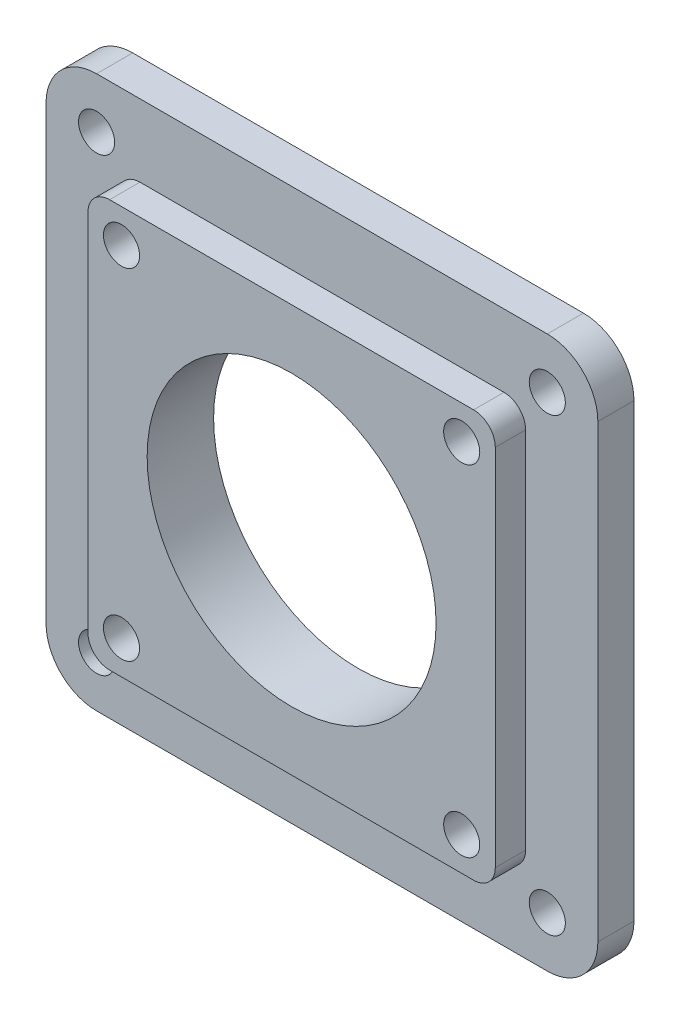
ISO-10303-21;
HEADER;
FILE_DESCRIPTION(('STEP AP214'),'2;1');
FILE_NAME('part.step','',(''),(''),'','','');
FILE_SCHEMA(('AUTOMOTIVE_DESIGN { 1 0 10303 214 1 1 1 1 }'));
ENDSEC;
DATA;
#1=APPLICATION_CONTEXT('core data for automotive mechanical design processes');
#2=APPLICATION_PROTOCOL_DEFINITION('international standard','automotive_design',2000,#1);
#3=PRODUCT_CONTEXT('',#1,'mechanical');
#4=PRODUCT('Part','Part','',(#3));
#5=PRODUCT_RELATED_PRODUCT_CATEGORY('part','',(#4));
#6=PRODUCT_DEFINITION_FORMATION('','',#4);
#7=PRODUCT_DEFINITION_CONTEXT('part definition',#1,'design');
#8=PRODUCT_DEFINITION('design','',#6,#7);
#9=PRODUCT_DEFINITION_SHAPE('','',#8);
#10=(LENGTH_UNIT() NAMED_UNIT(*) SI_UNIT(.MILLI.,.METRE.));
#11=(NAMED_UNIT(*) PLANE_ANGLE_UNIT() SI_UNIT($,.RADIAN.));
#12=(NAMED_UNIT(*) SI_UNIT($,.STERADIAN.) SOLID_ANGLE_UNIT());
#13=UNCERTAINTY_MEASURE_WITH_UNIT(LENGTH_MEASURE(1.E-05),#10,'distance_accuracy_value','');
#14=(GEOMETRIC_REPRESENTATION_CONTEXT(3) GLOBAL_UNCERTAINTY_ASSIGNED_CONTEXT((#13)) GLOBAL_UNIT_ASSIGNED_CONTEXT((#10,
#11,#12)) REPRESENTATION_CONTEXT('',''));
#15=CARTESIAN_POINT('',(0.,0.,0.));
#16=DIRECTION('',(0.,0.,1.));
#17=DIRECTION('',(1.,0.,0.));
#18=AXIS2_PLACEMENT_3D('',#15,#16,#17);
#19=CARTESIAN_POINT('',(28.2,-28.2,4.2));
#20=DIRECTION('',(-1.,0.,0.));
#21=DIRECTION('',(0.,0.,1.));
#22=AXIS2_PLACEMENT_3D('',#19,#20,#21);
#23=PLANE('',#22);
#24=DIRECTION('',(0.,1.,0.));
#25=VECTOR('',#24,1.);
#26=CARTESIAN_POINT('',(28.2,-28.2,4.2));
#27=LINE('',#26,#25);
#28=CARTESIAN_POINT('',(28.2,-25.2,4.2));
#29=VERTEX_POINT('',#28);
#30=CARTESIAN_POINT('',(28.2,25.2,4.2));
#31=VERTEX_POINT('',#30);
#32=EDGE_CURVE('E181',#29,#31,#27,.T.);
#33=ORIENTED_EDGE('',*,*,#32,.F.);
#34=DIRECTION('',(0.,0.,-1.));
#35=VECTOR('',#34,1.);
#36=CARTESIAN_POINT('',(28.2,-25.2,4.2));
#37=LINE('',#36,#35);
#38=CARTESIAN_POINT('',(28.2,-25.2,0.));
#39=VERTEX_POINT('',#38);
#40=EDGE_CURVE('E233',#29,#39,#37,.T.);
#41=ORIENTED_EDGE('',*,*,#40,.T.);
#42=DIRECTION('',(0.,1.,0.));
#43=VECTOR('',#42,1.);
#44=CARTESIAN_POINT('',(28.2,-28.2,0.));
#45=LINE('',#44,#43);
#46=CARTESIAN_POINT('',(28.2,25.2,0.));
#47=VERTEX_POINT('',#46);
#48=EDGE_CURVE('E194',#39,#47,#45,.T.);
#49=ORIENTED_EDGE('',*,*,#48,.T.);
#50=DIRECTION('',(0.,0.,-1.));
#51=VECTOR('',#50,1.);
#52=CARTESIAN_POINT('',(28.2,25.2,4.2));
#53=LINE('',#52,#51);
#54=EDGE_CURVE('E231',#47,#31,#53,.F.);
#55=ORIENTED_EDGE('',*,*,#54,.T.);
#56=EDGE_LOOP('',(#33,#41,#49,#55));
#57=FACE_BOUND('',#56,.T.);
#58=ADVANCED_FACE('F33',(#57),#23,.F.);
#59=CARTESIAN_POINT('',(-28.2,28.2,4.2));
#60=DIRECTION('',(0.,-1.,0.));
#61=DIRECTION('',(0.,0.,-1.));
#62=AXIS2_PLACEMENT_3D('',#59,#60,#61);
#63=PLANE('',#62);
#64=DIRECTION('',(-1.,0.,0.));
#65=VECTOR('',#64,1.);
#66=CARTESIAN_POINT('',(-28.2,28.2,4.2));
#67=LINE('',#66,#65);
#68=CARTESIAN_POINT('',(25.2,28.2,4.2));
#69=VERTEX_POINT('',#68);
#70=CARTESIAN_POINT('',(-25.2,28.2,4.2));
#71=VERTEX_POINT('',#70);
#72=EDGE_CURVE('E184',#69,#71,#67,.T.);
#73=ORIENTED_EDGE('',*,*,#72,.F.);
#74=DIRECTION('',(0.,0.,-1.));
#75=VECTOR('',#74,1.);
#76=CARTESIAN_POINT('',(25.2,28.2,4.2));
#77=LINE('',#76,#75);
#78=CARTESIAN_POINT('',(25.2,28.2,0.));
#79=VERTEX_POINT('',#78);
#80=EDGE_CURVE('E251',#69,#79,#77,.T.);
#81=ORIENTED_EDGE('',*,*,#80,.T.);
#82=DIRECTION('',(-1.,0.,0.));
#83=VECTOR('',#82,1.);
#84=CARTESIAN_POINT('',(-28.2,28.2,0.));
#85=LINE('',#84,#83);
#86=CARTESIAN_POINT('',(-25.2,28.2,0.));
#87=VERTEX_POINT('',#86);
#88=EDGE_CURVE('E197',#79,#87,#85,.T.);
#89=ORIENTED_EDGE('',*,*,#88,.T.);
#90=DIRECTION('',(0.,0.,-1.));
#91=VECTOR('',#90,1.);
#92=CARTESIAN_POINT('',(-25.2,28.2,4.2));
#93=LINE('',#92,#91);
#94=EDGE_CURVE('E249',#87,#71,#93,.F.);
#95=ORIENTED_EDGE('',*,*,#94,.T.);
#96=EDGE_LOOP('',(#73,#81,#89,#95));
#97=FACE_BOUND('',#96,.T.);
#98=ADVANCED_FACE('F276',(#97),#63,.F.);
#99=CARTESIAN_POINT('',(-28.2,-28.2,4.2));
#100=DIRECTION('',(1.,0.,0.));
#101=DIRECTION('',(0.,0.,-1.));
#102=AXIS2_PLACEMENT_3D('',#99,#100,#101);
#103=PLANE('',#102);
#104=DIRECTION('',(0.,-1.,0.));
#105=VECTOR('',#104,1.);
#106=CARTESIAN_POINT('',(-28.2,-28.2,0.));
#107=LINE('',#106,#105);
#108=CARTESIAN_POINT('',(-28.2,25.2,0.));
#109=VERTEX_POINT('',#108);
#110=CARTESIAN_POINT('',(-28.2,-25.2,0.));
#111=VERTEX_POINT('',#110);
#112=EDGE_CURVE('E201',#109,#111,#107,.T.);
#113=ORIENTED_EDGE('',*,*,#112,.T.);
#114=DIRECTION('',(0.,0.,-1.));
#115=VECTOR('',#114,1.);
#116=CARTESIAN_POINT('',(-28.2,-25.2,4.2));
#117=LINE('',#116,#115);
#118=CARTESIAN_POINT('',(-28.2,-25.2,4.2));
#119=VERTEX_POINT('',#118);
#120=EDGE_CURVE('E256',#111,#119,#117,.F.);
#121=ORIENTED_EDGE('',*,*,#120,.T.);
#122=DIRECTION('',(0.,-1.,0.));
#123=VECTOR('',#122,1.);
#124=CARTESIAN_POINT('',(-28.2,-28.2,4.2));
#125=LINE('',#124,#123);
#126=CARTESIAN_POINT('',(-28.2,25.2,4.2));
#127=VERTEX_POINT('',#126);
#128=EDGE_CURVE('E188',#127,#119,#125,.T.);
#129=ORIENTED_EDGE('',*,*,#128,.F.);
#130=DIRECTION('',(0.,0.,-1.));
#131=VECTOR('',#130,1.);
#132=CARTESIAN_POINT('',(-28.2,25.2,4.2));
#133=LINE('',#132,#131);
#134=EDGE_CURVE('E254',#127,#109,#133,.T.);
#135=ORIENTED_EDGE('',*,*,#134,.T.);
#136=EDGE_LOOP('',(#113,#121,#129,#135));
#137=FACE_BOUND('',#136,.T.);
#138=ADVANCED_FACE('F280',(#137),#103,.F.);
#139=CARTESIAN_POINT('',(-28.2,-28.2,4.2));
#140=DIRECTION('',(0.,1.,0.));
#141=DIRECTION('',(0.,0.,1.));
#142=AXIS2_PLACEMENT_3D('',#139,#140,#141);
#143=PLANE('',#142);
#144=DIRECTION('',(1.,0.,0.));
#145=VECTOR('',#144,1.);
#146=CARTESIAN_POINT('',(-28.2,-28.2,0.));
#147=LINE('',#146,#145);
#148=CARTESIAN_POINT('',(-25.2,-28.2,0.));
#149=VERTEX_POINT('',#148);
#150=CARTESIAN_POINT('',(25.2,-28.2,0.));
#151=VERTEX_POINT('',#150);
#152=EDGE_CURVE('E185',#149,#151,#147,.T.);
#153=ORIENTED_EDGE('',*,*,#152,.T.);
#154=DIRECTION('',(0.,0.,-1.));
#155=VECTOR('',#154,1.);
#156=CARTESIAN_POINT('',(25.2,-28.2,4.2));
#157=LINE('',#156,#155);
#158=CARTESIAN_POINT('',(25.2,-28.2,4.2));
#159=VERTEX_POINT('',#158);
#160=EDGE_CURVE('E239',#151,#159,#157,.F.);
#161=ORIENTED_EDGE('',*,*,#160,.T.);
#162=DIRECTION('',(1.,0.,0.));
#163=VECTOR('',#162,1.);
#164=CARTESIAN_POINT('',(-28.2,-28.2,4.2));
#165=LINE('',#164,#163);
#166=CARTESIAN_POINT('',(-25.2,-28.2,4.2));
#167=VERTEX_POINT('',#166);
#168=EDGE_CURVE('E191',#167,#159,#165,.T.);
#169=ORIENTED_EDGE('',*,*,#168,.F.);
#170=DIRECTION('',(0.,0.,-1.));
#171=VECTOR('',#170,1.);
#172=CARTESIAN_POINT('',(-25.2,-28.2,4.2));
#173=LINE('',#172,#171);
#174=EDGE_CURVE('E236',#167,#149,#173,.T.);
#175=ORIENTED_EDGE('',*,*,#174,.T.);
#176=EDGE_LOOP('',(#153,#161,#169,#175));
#177=FACE_BOUND('',#176,.T.);
#178=ADVANCED_FACE('F288',(#177),#143,.F.);
#179=CARTESIAN_POINT('',(0.,0.,4.2));
#180=DIRECTION('',(0.,0.,-1.));
#181=DIRECTION('',(-1.,0.,0.));
#182=AXIS2_PLACEMENT_3D('',#179,#180,#181);
#183=PLANE('',#182);
#184=CARTESIAN_POINT('',(0.,0.,4.2));
#185=DIRECTION('',(0.,0.,-1.));
#186=DIRECTION('',(-1.,0.,0.));
#187=AXIS2_PLACEMENT_3D('',#184,#185,#186);
#188=CIRCLE('',#187,20.);
#189=CARTESIAN_POINT('',(-20.,0.,4.2));
#190=VERTEX_POINT('',#189);
#191=EDGE_CURVE('E394',#190,#190,#188,.T.);
#192=ORIENTED_EDGE('',*,*,#191,.T.);
#193=EDGE_LOOP('',(#192));
#194=FACE_BOUND('',#193,.T.);
#195=CARTESIAN_POINT('',(23.55,-23.55,4.2));
#196=DIRECTION('',(0.,0.,1.));
#197=DIRECTION('',(1.,0.,0.));
#198=AXIS2_PLACEMENT_3D('',#195,#196,#197);
#199=CIRCLE('',#198,2.5);
#200=CARTESIAN_POINT('',(26.05,-23.55,4.2));
#201=VERTEX_POINT('',#200);
#202=EDGE_CURVE('E346',#201,#201,#199,.T.);
#203=ORIENTED_EDGE('',*,*,#202,.F.);
#204=EDGE_LOOP('',(#203));
#205=FACE_BOUND('',#204,.T.);
#206=CARTESIAN_POINT('',(-23.55,-23.55,4.2));
#207=DIRECTION('',(0.,0.,1.));
#208=DIRECTION('',(1.,0.,0.));
#209=AXIS2_PLACEMENT_3D('',#206,#207,#208);
#210=CIRCLE('',#209,2.5);
#211=CARTESIAN_POINT('',(-21.05,-23.55,4.2));
#212=VERTEX_POINT('',#211);
#213=EDGE_CURVE('E353',#212,#212,#210,.T.);
#214=ORIENTED_EDGE('',*,*,#213,.F.);
#215=EDGE_LOOP('',(#214));
#216=FACE_BOUND('',#215,.T.);
#217=CARTESIAN_POINT('',(-23.55,23.55,4.2));
#218=DIRECTION('',(0.,0.,1.));
#219=DIRECTION('',(1.,0.,0.));
#220=AXIS2_PLACEMENT_3D('',#217,#218,#219);
#221=CIRCLE('',#220,2.5);
#222=CARTESIAN_POINT('',(-21.05,23.55,4.2));
#223=VERTEX_POINT('',#222);
#224=EDGE_CURVE('E360',#223,#223,#221,.T.);
#225=ORIENTED_EDGE('',*,*,#224,.F.);
#226=EDGE_LOOP('',(#225));
#227=FACE_BOUND('',#226,.T.);
#228=CARTESIAN_POINT('',(23.55,23.55,4.2));
#229=DIRECTION('',(0.,0.,1.));
#230=DIRECTION('',(1.,0.,0.));
#231=AXIS2_PLACEMENT_3D('',#228,#229,#230);
#232=CIRCLE('',#231,2.5);
#233=CARTESIAN_POINT('',(26.05,23.55,4.2));
#234=VERTEX_POINT('',#233);
#235=EDGE_CURVE('E342',#234,#234,#232,.T.);
#236=ORIENTED_EDGE('',*,*,#235,.F.);
#237=EDGE_LOOP('',(#236));
#238=FACE_BOUND('',#237,.T.);
#239=ORIENTED_EDGE('',*,*,#168,.T.);
#240=CARTESIAN_POINT('',(25.2,-25.2,4.2));
#241=DIRECTION('',(0.,0.,-1.));
#242=DIRECTION('',(-1.,0.,0.));
#243=AXIS2_PLACEMENT_3D('',#240,#241,#242);
#244=CIRCLE('',#243,3.);
#245=EDGE_CURVE('E247',#159,#29,#244,.F.);
#246=ORIENTED_EDGE('',*,*,#245,.T.);
#247=ORIENTED_EDGE('',*,*,#32,.T.);
#248=CARTESIAN_POINT('',(25.2,25.2,4.2));
#249=DIRECTION('',(0.,0.,-1.));
#250=DIRECTION('',(-1.,0.,0.));
#251=AXIS2_PLACEMENT_3D('',#248,#249,#250);
#252=CIRCLE('',#251,3.);
#253=EDGE_CURVE('E245',#31,#69,#252,.F.);
#254=ORIENTED_EDGE('',*,*,#253,.T.);
#255=ORIENTED_EDGE('',*,*,#72,.T.);
#256=CARTESIAN_POINT('',(-25.2,25.2,4.2));
#257=DIRECTION('',(0.,0.,-1.));
#258=DIRECTION('',(-1.,0.,0.));
#259=AXIS2_PLACEMENT_3D('',#256,#257,#258);
#260=CIRCLE('',#259,3.);
#261=EDGE_CURVE('E241',#71,#127,#260,.F.);
#262=ORIENTED_EDGE('',*,*,#261,.T.);
#263=ORIENTED_EDGE('',*,*,#128,.T.);
#264=CARTESIAN_POINT('',(-25.2,-25.2,4.2));
#265=DIRECTION('',(0.,0.,-1.));
#266=DIRECTION('',(-1.,0.,0.));
#267=AXIS2_PLACEMENT_3D('',#264,#265,#266);
#268=CIRCLE('',#267,3.);
#269=EDGE_CURVE('E243',#119,#167,#268,.F.);
#270=ORIENTED_EDGE('',*,*,#269,.T.);
#271=EDGE_LOOP('',(#239,#246,#247,#254,#255,#262,#263,#270));
#272=FACE_BOUND('',#271,.T.);
#273=ADVANCED_FACE('F273',(#194,#205,#216,#227,#238,#272),#183,.F.);
#274=CARTESIAN_POINT('',(0.,0.,0.));
#275=DIRECTION('',(0.,0.,-1.));
#276=DIRECTION('',(-1.,0.,0.));
#277=AXIS2_PLACEMENT_3D('',#274,#275,#276);
#278=PLANE('',#277);
#279=CARTESIAN_POINT('',(31.1999999999999,31.2000000000001,0.));
#280=DIRECTION('',(0.,0.,-1.));
#281=DIRECTION('',(-1.,0.,0.));
#282=AXIS2_PLACEMENT_3D('',#279,#280,#281);
#283=CIRCLE('',#282,2.5);
#284=CARTESIAN_POINT('',(28.6999999999999,31.2000000000001,0.));
#285=VERTEX_POINT('',#284);
#286=EDGE_CURVE('E378',#285,#285,#283,.T.);
#287=ORIENTED_EDGE('',*,*,#286,.T.);
#288=EDGE_LOOP('',(#287));
#289=FACE_BOUND('',#288,.T.);
#290=CARTESIAN_POINT('',(-31.2000000000002,31.1999999999998,0.));
#291=DIRECTION('',(0.,0.,-1.));
#292=DIRECTION('',(-1.,0.,0.));
#293=AXIS2_PLACEMENT_3D('',#290,#291,#292);
#294=CIRCLE('',#293,2.5);
#295=CARTESIAN_POINT('',(-33.7000000000002,31.1999999999998,0.));
#296=VERTEX_POINT('',#295);
#297=EDGE_CURVE('E383',#296,#296,#294,.T.);
#298=ORIENTED_EDGE('',*,*,#297,.T.);
#299=EDGE_LOOP('',(#298));
#300=FACE_BOUND('',#299,.T.);
#301=CARTESIAN_POINT('',(-31.1999999999997,-31.2000000000003,0.));
#302=DIRECTION('',(0.,0.,-1.));
#303=DIRECTION('',(-1.,0.,0.));
#304=AXIS2_PLACEMENT_3D('',#301,#302,#303);
#305=CIRCLE('',#304,2.5);
#306=CARTESIAN_POINT('',(-33.6999999999997,-31.2000000000003,0.));
#307=VERTEX_POINT('',#306);
#308=EDGE_CURVE('E386',#307,#307,#305,.T.);
#309=ORIENTED_EDGE('',*,*,#308,.T.);
#310=EDGE_LOOP('',(#309));
#311=FACE_BOUND('',#310,.T.);
#312=CARTESIAN_POINT('',(31.2,-31.2,0.));
#313=DIRECTION('',(0.,0.,-1.));
#314=DIRECTION('',(-1.,0.,0.));
#315=AXIS2_PLACEMENT_3D('',#312,#313,#314);
#316=CIRCLE('',#315,2.5);
#317=CARTESIAN_POINT('',(28.7,-31.2,0.));
#318=VERTEX_POINT('',#317);
#319=EDGE_CURVE('E369',#318,#318,#316,.T.);
#320=ORIENTED_EDGE('',*,*,#319,.T.);
#321=EDGE_LOOP('',(#320));
#322=FACE_BOUND('',#321,.T.);
#323=DIRECTION('',(0.,1.,0.));
#324=VECTOR('',#323,1.);
#325=CARTESIAN_POINT('',(-38.2,-38.2,0.));
#326=LINE('',#325,#324);
#327=CARTESIAN_POINT('',(-38.2,-31.2,0.));
#328=VERTEX_POINT('',#327);
#329=CARTESIAN_POINT('',(-38.2,31.2,0.));
#330=VERTEX_POINT('',#329);
#331=EDGE_CURVE('E162',#328,#330,#326,.T.);
#332=ORIENTED_EDGE('',*,*,#331,.F.);
#333=CARTESIAN_POINT('',(-31.2,-31.2,0.));
#334=DIRECTION('',(0.,0.,-1.));
#335=DIRECTION('',(-1.,0.,0.));
#336=AXIS2_PLACEMENT_3D('',#333,#334,#335);
#337=CIRCLE('',#336,7.);
#338=CARTESIAN_POINT('',(-31.2,-38.2,0.));
#339=VERTEX_POINT('',#338);
#340=EDGE_CURVE('E145',#328,#339,#337,.F.);
#341=ORIENTED_EDGE('',*,*,#340,.T.);
#342=DIRECTION('',(-1.,0.,0.));
#343=VECTOR('',#342,1.);
#344=CARTESIAN_POINT('',(-38.2,-38.2,0.));
#345=LINE('',#344,#343);
#346=CARTESIAN_POINT('',(31.2,-38.2,0.));
#347=VERTEX_POINT('',#346);
#348=EDGE_CURVE('E172',#347,#339,#345,.T.);
#349=ORIENTED_EDGE('',*,*,#348,.F.);
#350=CARTESIAN_POINT('',(31.2,-31.2,0.));
#351=DIRECTION('',(0.,0.,-1.));
#352=DIRECTION('',(-1.,0.,0.));
#353=AXIS2_PLACEMENT_3D('',#350,#351,#352);
#354=CIRCLE('',#353,7.);
#355=CARTESIAN_POINT('',(38.2,-31.2,0.));
#356=VERTEX_POINT('',#355);
#357=EDGE_CURVE('E166',#347,#356,#354,.F.);
#358=ORIENTED_EDGE('',*,*,#357,.T.);
#359=DIRECTION('',(0.,-1.,0.));
#360=VECTOR('',#359,1.);
#361=CARTESIAN_POINT('',(38.2,-38.2,0.));
#362=LINE('',#361,#360);
#363=CARTESIAN_POINT('',(38.2,31.2,0.));
#364=VERTEX_POINT('',#363);
#365=EDGE_CURVE('E177',#364,#356,#362,.T.);
#366=ORIENTED_EDGE('',*,*,#365,.F.);
#367=CARTESIAN_POINT('',(31.2,31.2,0.));
#368=DIRECTION('',(0.,0.,-1.));
#369=DIRECTION('',(-1.,0.,0.));
#370=AXIS2_PLACEMENT_3D('',#367,#368,#369);
#371=CIRCLE('',#370,7.);
#372=CARTESIAN_POINT('',(31.2,38.2,0.));
#373=VERTEX_POINT('',#372);
#374=EDGE_CURVE('E207',#364,#373,#371,.F.);
#375=ORIENTED_EDGE('',*,*,#374,.T.);
#376=DIRECTION('',(1.,0.,0.));
#377=VECTOR('',#376,1.);
#378=CARTESIAN_POINT('',(-38.2,38.2,0.));
#379=LINE('',#378,#377);
#380=CARTESIAN_POINT('',(-31.2,38.2,0.));
#381=VERTEX_POINT('',#380);
#382=EDGE_CURVE('E171',#381,#373,#379,.T.);
#383=ORIENTED_EDGE('',*,*,#382,.F.);
#384=CARTESIAN_POINT('',(-31.2,31.2,0.));
#385=DIRECTION('',(0.,0.,-1.));
#386=DIRECTION('',(-1.,0.,0.));
#387=AXIS2_PLACEMENT_3D('',#384,#385,#386);
#388=CIRCLE('',#387,7.);
#389=EDGE_CURVE('E156',#381,#330,#388,.F.);
#390=ORIENTED_EDGE('',*,*,#389,.T.);
#391=EDGE_LOOP('',(#332,#341,#349,#358,#366,#375,#383,#390));
#392=FACE_BOUND('',#391,.T.);
#393=ORIENTED_EDGE('',*,*,#88,.F.);
#394=CARTESIAN_POINT('',(25.2,25.2,0.));
#395=DIRECTION('',(0.,0.,-1.));
#396=DIRECTION('',(-1.,0.,0.));
#397=AXIS2_PLACEMENT_3D('',#394,#395,#396);
#398=CIRCLE('',#397,3.);
#399=EDGE_CURVE('E260',#79,#47,#398,.T.);
#400=ORIENTED_EDGE('',*,*,#399,.T.);
#401=ORIENTED_EDGE('',*,*,#48,.F.);
#402=CARTESIAN_POINT('',(25.2,-25.2,0.));
#403=DIRECTION('',(0.,0.,-1.));
#404=DIRECTION('',(-1.,0.,0.));
#405=AXIS2_PLACEMENT_3D('',#402,#403,#404);
#406=CIRCLE('',#405,3.);
#407=EDGE_CURVE('E258',#39,#151,#406,.T.);
#408=ORIENTED_EDGE('',*,*,#407,.T.);
#409=ORIENTED_EDGE('',*,*,#152,.F.);
#410=CARTESIAN_POINT('',(-25.2,-25.2,0.));
#411=DIRECTION('',(0.,0.,-1.));
#412=DIRECTION('',(-1.,0.,0.));
#413=AXIS2_PLACEMENT_3D('',#410,#411,#412);
#414=CIRCLE('',#413,3.);
#415=EDGE_CURVE('E41',#149,#111,#414,.T.);
#416=ORIENTED_EDGE('',*,*,#415,.T.);
#417=ORIENTED_EDGE('',*,*,#112,.F.);
#418=CARTESIAN_POINT('',(-25.2,25.2,0.));
#419=DIRECTION('',(0.,0.,-1.));
#420=DIRECTION('',(-1.,0.,0.));
#421=AXIS2_PLACEMENT_3D('',#418,#419,#420);
#422=CIRCLE('',#421,3.);
#423=EDGE_CURVE('E11',#109,#87,#422,.T.);
#424=ORIENTED_EDGE('',*,*,#423,.T.);
#425=EDGE_LOOP('',(#393,#400,#401,#408,#409,#416,#417,#424));
#426=FACE_BOUND('',#425,.T.);
#427=ADVANCED_FACE('F169',(#289,#300,#311,#322,#392,#426),#278,.F.);
#428=CARTESIAN_POINT('',(38.2,-38.2,-5.));
#429=DIRECTION('',(-1.,0.,0.));
#430=DIRECTION('',(0.,0.,1.));
#431=AXIS2_PLACEMENT_3D('',#428,#429,#430);
#432=PLANE('',#431);
#433=DIRECTION('',(0.,-1.,0.));
#434=VECTOR('',#433,1.);
#435=CARTESIAN_POINT('',(38.2,-38.2,-5.));
#436=LINE('',#435,#434);
#437=CARTESIAN_POINT('',(38.2,31.2,-5.));
#438=VERTEX_POINT('',#437);
#439=CARTESIAN_POINT('',(38.2,-31.2,-5.));
#440=VERTEX_POINT('',#439);
#441=EDGE_CURVE('E175',#438,#440,#436,.T.);
#442=ORIENTED_EDGE('',*,*,#441,.F.);
#443=DIRECTION('',(0.,0.,1.));
#444=VECTOR('',#443,1.);
#445=CARTESIAN_POINT('',(38.2,31.2,-5.));
#446=LINE('',#445,#444);
#447=EDGE_CURVE('E228',#438,#364,#446,.T.);
#448=ORIENTED_EDGE('',*,*,#447,.T.);
#449=ORIENTED_EDGE('',*,*,#365,.T.);
#450=DIRECTION('',(0.,0.,1.));
#451=VECTOR('',#450,1.);
#452=CARTESIAN_POINT('',(38.2,-31.2,-5.));
#453=LINE('',#452,#451);
#454=EDGE_CURVE('E226',#356,#440,#453,.F.);
#455=ORIENTED_EDGE('',*,*,#454,.T.);
#456=EDGE_LOOP('',(#442,#448,#449,#455));
#457=FACE_BOUND('',#456,.T.);
#458=ADVANCED_FACE('F334',(#457),#432,.F.);
#459=CARTESIAN_POINT('',(-38.2,-38.2,-5.));
#460=DIRECTION('',(0.,1.,0.));
#461=DIRECTION('',(0.,0.,1.));
#462=AXIS2_PLACEMENT_3D('',#459,#460,#461);
#463=PLANE('',#462);
#464=ORIENTED_EDGE('',*,*,#348,.T.);
#465=DIRECTION('',(0.,0.,1.));
#466=VECTOR('',#465,1.);
#467=CARTESIAN_POINT('',(-31.2,-38.2,-5.));
#468=LINE('',#467,#466);
#469=CARTESIAN_POINT('',(-31.2,-38.2,-5.));
#470=VERTEX_POINT('',#469);
#471=EDGE_CURVE('E150',#339,#470,#468,.F.);
#472=ORIENTED_EDGE('',*,*,#471,.T.);
#473=DIRECTION('',(-1.,0.,0.));
#474=VECTOR('',#473,1.);
#475=CARTESIAN_POINT('',(-38.2,-38.2,-5.));
#476=LINE('',#475,#474);
#477=CARTESIAN_POINT('',(31.2,-38.2,-5.));
#478=VERTEX_POINT('',#477);
#479=EDGE_CURVE('E338',#478,#470,#476,.T.);
#480=ORIENTED_EDGE('',*,*,#479,.F.);
#481=DIRECTION('',(0.,0.,1.));
#482=VECTOR('',#481,1.);
#483=CARTESIAN_POINT('',(31.2,-38.2,-5.));
#484=LINE('',#483,#482);
#485=EDGE_CURVE('E155',#478,#347,#484,.T.);
#486=ORIENTED_EDGE('',*,*,#485,.T.);
#487=EDGE_LOOP('',(#464,#472,#480,#486));
#488=FACE_BOUND('',#487,.T.);
#489=ADVANCED_FACE('F455',(#488),#463,.F.);
#490=CARTESIAN_POINT('',(-38.2,-38.2,-5.));
#491=DIRECTION('',(1.,0.,0.));
#492=DIRECTION('',(0.,0.,-1.));
#493=AXIS2_PLACEMENT_3D('',#490,#491,#492);
#494=PLANE('',#493);
#495=DIRECTION('',(0.,1.,0.));
#496=VECTOR('',#495,1.);
#497=CARTESIAN_POINT('',(-38.2,-38.2,-5.));
#498=LINE('',#497,#496);
#499=CARTESIAN_POINT('',(-38.2,-31.2,-5.));
#500=VERTEX_POINT('',#499);
#501=CARTESIAN_POINT('',(-38.2,31.2,-5.));
#502=VERTEX_POINT('',#501);
#503=EDGE_CURVE('E165',#500,#502,#498,.T.);
#504=ORIENTED_EDGE('',*,*,#503,.F.);
#505=DIRECTION('',(0.,0.,1.));
#506=VECTOR('',#505,1.);
#507=CARTESIAN_POINT('',(-38.2,-31.2,-5.));
#508=LINE('',#507,#506);
#509=EDGE_CURVE('E149',#500,#328,#508,.T.);
#510=ORIENTED_EDGE('',*,*,#509,.T.);
#511=ORIENTED_EDGE('',*,*,#331,.T.);
#512=DIRECTION('',(0.,0.,1.));
#513=VECTOR('',#512,1.);
#514=CARTESIAN_POINT('',(-38.2,31.2,-5.));
#515=LINE('',#514,#513);
#516=EDGE_CURVE('E167',#330,#502,#515,.F.);
#517=ORIENTED_EDGE('',*,*,#516,.T.);
#518=EDGE_LOOP('',(#504,#510,#511,#517));
#519=FACE_BOUND('',#518,.T.);
#520=ADVANCED_FACE('F161',(#519),#494,.F.);
#521=CARTESIAN_POINT('',(-38.2,38.2,-5.));
#522=DIRECTION('',(0.,-1.,0.));
#523=DIRECTION('',(0.,0.,-1.));
#524=AXIS2_PLACEMENT_3D('',#521,#522,#523);
#525=PLANE('',#524);
#526=DIRECTION('',(1.,0.,0.));
#527=VECTOR('',#526,1.);
#528=CARTESIAN_POINT('',(-38.2,38.2,-5.));
#529=LINE('',#528,#527);
#530=CARTESIAN_POINT('',(-31.2,38.2,-5.));
#531=VERTEX_POINT('',#530);
#532=CARTESIAN_POINT('',(31.2,38.2,-5.));
#533=VERTEX_POINT('',#532);
#534=EDGE_CURVE('E198',#531,#533,#529,.T.);
#535=ORIENTED_EDGE('',*,*,#534,.F.);
#536=DIRECTION('',(0.,0.,1.));
#537=VECTOR('',#536,1.);
#538=CARTESIAN_POINT('',(-31.2,38.2,-5.));
#539=LINE('',#538,#537);
#540=EDGE_CURVE('E223',#531,#381,#539,.T.);
#541=ORIENTED_EDGE('',*,*,#540,.T.);
#542=ORIENTED_EDGE('',*,*,#382,.T.);
#543=DIRECTION('',(0.,0.,1.));
#544=VECTOR('',#543,1.);
#545=CARTESIAN_POINT('',(31.2,38.2,-5.));
#546=LINE('',#545,#544);
#547=EDGE_CURVE('E221',#373,#533,#546,.F.);
#548=ORIENTED_EDGE('',*,*,#547,.T.);
#549=EDGE_LOOP('',(#535,#541,#542,#548));
#550=FACE_BOUND('',#549,.T.);
#551=ADVANCED_FACE('F411',(#550),#525,.F.);
#552=CARTESIAN_POINT('',(0.,0.,-5.));
#553=DIRECTION('',(0.,0.,-1.));
#554=DIRECTION('',(-1.,0.,0.));
#555=AXIS2_PLACEMENT_3D('',#552,#553,#554);
#556=PLANE('',#555);
#557=CARTESIAN_POINT('',(0.,0.,-5.));
#558=DIRECTION('',(0.,0.,-1.));
#559=DIRECTION('',(-1.,0.,0.));
#560=AXIS2_PLACEMENT_3D('',#557,#558,#559);
#561=CIRCLE('',#560,20.);
#562=CARTESIAN_POINT('',(-20.,0.,-5.));
#563=VERTEX_POINT('',#562);
#564=EDGE_CURVE('E401',#563,#563,#561,.T.);
#565=ORIENTED_EDGE('',*,*,#564,.F.);
#566=EDGE_LOOP('',(#565));
#567=FACE_BOUND('',#566,.T.);
#568=CARTESIAN_POINT('',(31.1999999999999,31.2000000000001,-5.));
#569=DIRECTION('',(0.,0.,-1.));
#570=DIRECTION('',(-1.,0.,0.));
#571=AXIS2_PLACEMENT_3D('',#568,#569,#570);
#572=CIRCLE('',#571,2.5);
#573=CARTESIAN_POINT('',(28.6999999999999,31.2000000000001,-5.));
#574=VERTEX_POINT('',#573);
#575=EDGE_CURVE('E389',#574,#574,#572,.T.);
#576=ORIENTED_EDGE('',*,*,#575,.F.);
#577=EDGE_LOOP('',(#576));
#578=FACE_BOUND('',#577,.T.);
#579=CARTESIAN_POINT('',(-31.2000000000002,31.1999999999998,-5.));
#580=DIRECTION('',(0.,0.,-1.));
#581=DIRECTION('',(-1.,0.,0.));
#582=AXIS2_PLACEMENT_3D('',#579,#580,#581);
#583=CIRCLE('',#582,2.5);
#584=CARTESIAN_POINT('',(-33.7000000000002,31.1999999999998,-5.));
#585=VERTEX_POINT('',#584);
#586=EDGE_CURVE('E393',#585,#585,#583,.T.);
#587=ORIENTED_EDGE('',*,*,#586,.F.);
#588=EDGE_LOOP('',(#587));
#589=FACE_BOUND('',#588,.T.);
#590=CARTESIAN_POINT('',(-31.1999999999997,-31.2000000000003,-5.));
#591=DIRECTION('',(0.,0.,-1.));
#592=DIRECTION('',(-1.,0.,0.));
#593=AXIS2_PLACEMENT_3D('',#590,#591,#592);
#594=CIRCLE('',#593,2.5);
#595=CARTESIAN_POINT('',(-33.6999999999997,-31.2000000000003,-5.));
#596=VERTEX_POINT('',#595);
#597=EDGE_CURVE('E390',#596,#596,#594,.T.);
#598=ORIENTED_EDGE('',*,*,#597,.F.);
#599=EDGE_LOOP('',(#598));
#600=FACE_BOUND('',#599,.T.);
#601=CARTESIAN_POINT('',(31.2,-31.2,-5.));
#602=DIRECTION('',(0.,0.,-1.));
#603=DIRECTION('',(-1.,0.,0.));
#604=AXIS2_PLACEMENT_3D('',#601,#602,#603);
#605=CIRCLE('',#604,2.5);
#606=CARTESIAN_POINT('',(28.7,-31.2,-5.));
#607=VERTEX_POINT('',#606);
#608=EDGE_CURVE('E374',#607,#607,#605,.T.);
#609=ORIENTED_EDGE('',*,*,#608,.F.);
#610=EDGE_LOOP('',(#609));
#611=FACE_BOUND('',#610,.T.);
#612=CARTESIAN_POINT('',(23.55,-23.55,-5.));
#613=DIRECTION('',(0.,0.,1.));
#614=DIRECTION('',(1.,0.,0.));
#615=AXIS2_PLACEMENT_3D('',#612,#613,#614);
#616=CIRCLE('',#615,2.5);
#617=CARTESIAN_POINT('',(26.05,-23.55,-5.));
#618=VERTEX_POINT('',#617);
#619=EDGE_CURVE('E348',#618,#618,#616,.T.);
#620=ORIENTED_EDGE('',*,*,#619,.T.);
#621=EDGE_LOOP('',(#620));
#622=FACE_BOUND('',#621,.T.);
#623=CARTESIAN_POINT('',(-23.55,-23.55,-5.));
#624=DIRECTION('',(0.,0.,1.));
#625=DIRECTION('',(1.,0.,0.));
#626=AXIS2_PLACEMENT_3D('',#623,#624,#625);
#627=CIRCLE('',#626,2.5);
#628=CARTESIAN_POINT('',(-21.05,-23.55,-5.));
#629=VERTEX_POINT('',#628);
#630=EDGE_CURVE('E357',#629,#629,#627,.T.);
#631=ORIENTED_EDGE('',*,*,#630,.T.);
#632=EDGE_LOOP('',(#631));
#633=FACE_BOUND('',#632,.T.);
#634=CARTESIAN_POINT('',(-23.55,23.55,-5.));
#635=DIRECTION('',(0.,0.,1.));
#636=DIRECTION('',(1.,0.,0.));
#637=AXIS2_PLACEMENT_3D('',#634,#635,#636);
#638=CIRCLE('',#637,2.5);
#639=CARTESIAN_POINT('',(-21.05,23.55,-5.));
#640=VERTEX_POINT('',#639);
#641=EDGE_CURVE('E363',#640,#640,#638,.T.);
#642=ORIENTED_EDGE('',*,*,#641,.T.);
#643=EDGE_LOOP('',(#642));
#644=FACE_BOUND('',#643,.T.);
#645=CARTESIAN_POINT('',(23.55,23.55,-5.));
#646=DIRECTION('',(0.,0.,1.));
#647=DIRECTION('',(1.,0.,0.));
#648=AXIS2_PLACEMENT_3D('',#645,#646,#647);
#649=CIRCLE('',#648,2.5);
#650=CARTESIAN_POINT('',(26.05,23.55,-5.));
#651=VERTEX_POINT('',#650);
#652=EDGE_CURVE('E367',#651,#651,#649,.T.);
#653=ORIENTED_EDGE('',*,*,#652,.T.);
#654=EDGE_LOOP('',(#653));
#655=FACE_BOUND('',#654,.T.);
#656=ORIENTED_EDGE('',*,*,#479,.T.);
#657=CARTESIAN_POINT('',(-31.2,-31.2,-5.));
#658=DIRECTION('',(0.,0.,-1.));
#659=DIRECTION('',(-1.,0.,0.));
#660=AXIS2_PLACEMENT_3D('',#657,#658,#659);
#661=CIRCLE('',#660,7.);
#662=EDGE_CURVE('E219',#470,#500,#661,.T.);
#663=ORIENTED_EDGE('',*,*,#662,.T.);
#664=ORIENTED_EDGE('',*,*,#503,.T.);
#665=CARTESIAN_POINT('',(-31.2,31.2,-5.));
#666=DIRECTION('',(0.,0.,-1.));
#667=DIRECTION('',(-1.,0.,0.));
#668=AXIS2_PLACEMENT_3D('',#665,#666,#667);
#669=CIRCLE('',#668,7.);
#670=EDGE_CURVE('E217',#502,#531,#669,.T.);
#671=ORIENTED_EDGE('',*,*,#670,.T.);
#672=ORIENTED_EDGE('',*,*,#534,.T.);
#673=CARTESIAN_POINT('',(31.2,31.2,-5.));
#674=DIRECTION('',(0.,0.,-1.));
#675=DIRECTION('',(-1.,0.,0.));
#676=AXIS2_PLACEMENT_3D('',#673,#674,#675);
#677=CIRCLE('',#676,7.);
#678=EDGE_CURVE('E215',#533,#438,#677,.T.);
#679=ORIENTED_EDGE('',*,*,#678,.T.);
#680=ORIENTED_EDGE('',*,*,#441,.T.);
#681=CARTESIAN_POINT('',(31.2,-31.2,-5.));
#682=DIRECTION('',(0.,0.,-1.));
#683=DIRECTION('',(-1.,0.,0.));
#684=AXIS2_PLACEMENT_3D('',#681,#682,#683);
#685=CIRCLE('',#684,7.);
#686=EDGE_CURVE('E213',#440,#478,#685,.T.);
#687=ORIENTED_EDGE('',*,*,#686,.T.);
#688=EDGE_LOOP('',(#656,#663,#664,#671,#672,#679,#680,#687));
#689=FACE_BOUND('',#688,.T.);
#690=ADVANCED_FACE('F330',(#567,#578,#589,#600,#611,#622,#633,#644,#655,#689),#556,.T.);
#691=CARTESIAN_POINT('',(23.55,23.55,-5.));
#692=DIRECTION('',(0.,0.,1.));
#693=DIRECTION('',(1.,0.,0.));
#694=AXIS2_PLACEMENT_3D('',#691,#692,#693);
#695=CYLINDRICAL_SURFACE('',#694,2.5);
#696=ORIENTED_EDGE('',*,*,#652,.F.);
#697=EDGE_LOOP('',(#696));
#698=FACE_BOUND('',#697,.T.);
#699=ORIENTED_EDGE('',*,*,#235,.T.);
#700=EDGE_LOOP('',(#699));
#701=FACE_BOUND('',#700,.T.);
#702=ADVANCED_FACE('F410',(#698,#701),#695,.F.);
#703=CARTESIAN_POINT('',(-23.55,23.55,-5.));
#704=DIRECTION('',(0.,0.,1.));
#705=DIRECTION('',(1.,0.,0.));
#706=AXIS2_PLACEMENT_3D('',#703,#704,#705);
#707=CYLINDRICAL_SURFACE('',#706,2.5);
#708=ORIENTED_EDGE('',*,*,#641,.F.);
#709=EDGE_LOOP('',(#708));
#710=FACE_BOUND('',#709,.T.);
#711=ORIENTED_EDGE('',*,*,#224,.T.);
#712=EDGE_LOOP('',(#711));
#713=FACE_BOUND('',#712,.T.);
#714=ADVANCED_FACE('F427',(#710,#713),#707,.F.);
#715=CARTESIAN_POINT('',(-23.55,-23.55,-5.));
#716=DIRECTION('',(0.,0.,1.));
#717=DIRECTION('',(1.,0.,0.));
#718=AXIS2_PLACEMENT_3D('',#715,#716,#717);
#719=CYLINDRICAL_SURFACE('',#718,2.5);
#720=ORIENTED_EDGE('',*,*,#630,.F.);
#721=EDGE_LOOP('',(#720));
#722=FACE_BOUND('',#721,.T.);
#723=ORIENTED_EDGE('',*,*,#213,.T.);
#724=EDGE_LOOP('',(#723));
#725=FACE_BOUND('',#724,.T.);
#726=ADVANCED_FACE('F430',(#722,#725),#719,.F.);
#727=CARTESIAN_POINT('',(23.55,-23.55,-5.));
#728=DIRECTION('',(0.,0.,1.));
#729=DIRECTION('',(1.,0.,0.));
#730=AXIS2_PLACEMENT_3D('',#727,#728,#729);
#731=CYLINDRICAL_SURFACE('',#730,2.5);
#732=ORIENTED_EDGE('',*,*,#619,.F.);
#733=EDGE_LOOP('',(#732));
#734=FACE_BOUND('',#733,.T.);
#735=ORIENTED_EDGE('',*,*,#202,.T.);
#736=EDGE_LOOP('',(#735));
#737=FACE_BOUND('',#736,.T.);
#738=ADVANCED_FACE('F314',(#734,#737),#731,.F.);
#739=CARTESIAN_POINT('',(-31.2,-31.2,-5.));
#740=DIRECTION('',(0.,0.,1.));
#741=DIRECTION('',(1.,0.,0.));
#742=AXIS2_PLACEMENT_3D('',#739,#740,#741);
#743=CYLINDRICAL_SURFACE('',#742,7.);
#744=ORIENTED_EDGE('',*,*,#662,.F.);
#745=ORIENTED_EDGE('',*,*,#471,.F.);
#746=ORIENTED_EDGE('',*,*,#340,.F.);
#747=ORIENTED_EDGE('',*,*,#509,.F.);
#748=EDGE_LOOP('',(#744,#745,#746,#747));
#749=FACE_BOUND('',#748,.T.);
#750=ADVANCED_FACE('F148',(#749),#743,.T.);
#751=CARTESIAN_POINT('',(-31.2,31.2,-5.));
#752=DIRECTION('',(0.,0.,1.));
#753=DIRECTION('',(1.,0.,0.));
#754=AXIS2_PLACEMENT_3D('',#751,#752,#753);
#755=CYLINDRICAL_SURFACE('',#754,7.);
#756=ORIENTED_EDGE('',*,*,#670,.F.);
#757=ORIENTED_EDGE('',*,*,#516,.F.);
#758=ORIENTED_EDGE('',*,*,#389,.F.);
#759=ORIENTED_EDGE('',*,*,#540,.F.);
#760=EDGE_LOOP('',(#756,#757,#758,#759));
#761=FACE_BOUND('',#760,.T.);
#762=ADVANCED_FACE('F313',(#761),#755,.T.);
#763=CARTESIAN_POINT('',(31.2,31.2,-5.));
#764=DIRECTION('',(0.,0.,1.));
#765=DIRECTION('',(1.,0.,0.));
#766=AXIS2_PLACEMENT_3D('',#763,#764,#765);
#767=CYLINDRICAL_SURFACE('',#766,7.);
#768=ORIENTED_EDGE('',*,*,#678,.F.);
#769=ORIENTED_EDGE('',*,*,#547,.F.);
#770=ORIENTED_EDGE('',*,*,#374,.F.);
#771=ORIENTED_EDGE('',*,*,#447,.F.);
#772=EDGE_LOOP('',(#768,#769,#770,#771));
#773=FACE_BOUND('',#772,.T.);
#774=ADVANCED_FACE('F300',(#773),#767,.T.);
#775=CARTESIAN_POINT('',(31.2,-31.2,-5.));
#776=DIRECTION('',(0.,0.,1.));
#777=DIRECTION('',(1.,0.,0.));
#778=AXIS2_PLACEMENT_3D('',#775,#776,#777);
#779=CYLINDRICAL_SURFACE('',#778,7.);
#780=ORIENTED_EDGE('',*,*,#686,.F.);
#781=ORIENTED_EDGE('',*,*,#454,.F.);
#782=ORIENTED_EDGE('',*,*,#357,.F.);
#783=ORIENTED_EDGE('',*,*,#485,.F.);
#784=EDGE_LOOP('',(#780,#781,#782,#783));
#785=FACE_BOUND('',#784,.T.);
#786=ADVANCED_FACE('F293',(#785),#779,.T.);
#787=CARTESIAN_POINT('',(25.2,-25.2,4.2));
#788=DIRECTION('',(0.,0.,-1.));
#789=DIRECTION('',(-1.,0.,0.));
#790=AXIS2_PLACEMENT_3D('',#787,#788,#789);
#791=CYLINDRICAL_SURFACE('',#790,3.);
#792=ORIENTED_EDGE('',*,*,#245,.F.);
#793=ORIENTED_EDGE('',*,*,#160,.F.);
#794=ORIENTED_EDGE('',*,*,#407,.F.);
#795=ORIENTED_EDGE('',*,*,#40,.F.);
#796=EDGE_LOOP('',(#792,#793,#794,#795));
#797=FACE_BOUND('',#796,.T.);
#798=ADVANCED_FACE('F291',(#797),#791,.T.);
#799=CARTESIAN_POINT('',(25.2,25.2,4.2));
#800=DIRECTION('',(0.,0.,-1.));
#801=DIRECTION('',(-1.,0.,0.));
#802=AXIS2_PLACEMENT_3D('',#799,#800,#801);
#803=CYLINDRICAL_SURFACE('',#802,3.);
#804=ORIENTED_EDGE('',*,*,#253,.F.);
#805=ORIENTED_EDGE('',*,*,#54,.F.);
#806=ORIENTED_EDGE('',*,*,#399,.F.);
#807=ORIENTED_EDGE('',*,*,#80,.F.);
#808=EDGE_LOOP('',(#804,#805,#806,#807));
#809=FACE_BOUND('',#808,.T.);
#810=ADVANCED_FACE('F270',(#809),#803,.T.);
#811=CARTESIAN_POINT('',(-25.2,-25.2,4.2));
#812=DIRECTION('',(0.,0.,-1.));
#813=DIRECTION('',(-1.,0.,0.));
#814=AXIS2_PLACEMENT_3D('',#811,#812,#813);
#815=CYLINDRICAL_SURFACE('',#814,3.);
#816=ORIENTED_EDGE('',*,*,#269,.F.);
#817=ORIENTED_EDGE('',*,*,#120,.F.);
#818=ORIENTED_EDGE('',*,*,#415,.F.);
#819=ORIENTED_EDGE('',*,*,#174,.F.);
#820=EDGE_LOOP('',(#816,#817,#818,#819));
#821=FACE_BOUND('',#820,.T.);
#822=ADVANCED_FACE('F283',(#821),#815,.T.);
#823=CARTESIAN_POINT('',(-25.2,25.2,4.2));
#824=DIRECTION('',(0.,0.,-1.));
#825=DIRECTION('',(-1.,0.,0.));
#826=AXIS2_PLACEMENT_3D('',#823,#824,#825);
#827=CYLINDRICAL_SURFACE('',#826,3.);
#828=ORIENTED_EDGE('',*,*,#261,.F.);
#829=ORIENTED_EDGE('',*,*,#94,.F.);
#830=ORIENTED_EDGE('',*,*,#423,.F.);
#831=ORIENTED_EDGE('',*,*,#134,.F.);
#832=EDGE_LOOP('',(#828,#829,#830,#831));
#833=FACE_BOUND('',#832,.T.);
#834=ADVANCED_FACE('F35',(#833),#827,.T.);
#835=CARTESIAN_POINT('',(31.2,-31.2,5.));
#836=DIRECTION('',(0.,0.,-1.));
#837=DIRECTION('',(-1.,0.,0.));
#838=AXIS2_PLACEMENT_3D('',#835,#836,#837);
#839=CYLINDRICAL_SURFACE('',#838,2.5);
#840=ORIENTED_EDGE('',*,*,#608,.T.);
#841=EDGE_LOOP('',(#840));
#842=FACE_BOUND('',#841,.T.);
#843=ORIENTED_EDGE('',*,*,#319,.F.);
#844=EDGE_LOOP('',(#843));
#845=FACE_BOUND('',#844,.T.);
#846=ADVANCED_FACE('F537',(#842,#845),#839,.F.);
#847=CARTESIAN_POINT('',(-31.1999999999997,-31.2000000000003,5.));
#848=DIRECTION('',(0.,0.,-1.));
#849=DIRECTION('',(-1.,0.,0.));
#850=AXIS2_PLACEMENT_3D('',#847,#848,#849);
#851=CYLINDRICAL_SURFACE('',#850,2.5);
#852=ORIENTED_EDGE('',*,*,#597,.T.);
#853=EDGE_LOOP('',(#852));
#854=FACE_BOUND('',#853,.T.);
#855=ORIENTED_EDGE('',*,*,#308,.F.);
#856=EDGE_LOOP('',(#855));
#857=FACE_BOUND('',#856,.T.);
#858=ADVANCED_FACE('F529',(#854,#857),#851,.F.);
#859=CARTESIAN_POINT('',(-31.2000000000002,31.1999999999998,5.));
#860=DIRECTION('',(0.,0.,-1.));
#861=DIRECTION('',(-1.,0.,0.));
#862=AXIS2_PLACEMENT_3D('',#859,#860,#861);
#863=CYLINDRICAL_SURFACE('',#862,2.5);
#864=ORIENTED_EDGE('',*,*,#586,.T.);
#865=EDGE_LOOP('',(#864));
#866=FACE_BOUND('',#865,.T.);
#867=ORIENTED_EDGE('',*,*,#297,.F.);
#868=EDGE_LOOP('',(#867));
#869=FACE_BOUND('',#868,.T.);
#870=ADVANCED_FACE('F522',(#866,#869),#863,.F.);
#871=CARTESIAN_POINT('',(31.1999999999999,31.2000000000001,5.));
#872=DIRECTION('',(0.,0.,-1.));
#873=DIRECTION('',(-1.,0.,0.));
#874=AXIS2_PLACEMENT_3D('',#871,#872,#873);
#875=CYLINDRICAL_SURFACE('',#874,2.5);
#876=ORIENTED_EDGE('',*,*,#575,.T.);
#877=EDGE_LOOP('',(#876));
#878=FACE_BOUND('',#877,.T.);
#879=ORIENTED_EDGE('',*,*,#286,.F.);
#880=EDGE_LOOP('',(#879));
#881=FACE_BOUND('',#880,.T.);
#882=ADVANCED_FACE('F513',(#878,#881),#875,.F.);
#883=CARTESIAN_POINT('',(0.,0.,5.));
#884=DIRECTION('',(0.,0.,-1.));
#885=DIRECTION('',(-1.,0.,0.));
#886=AXIS2_PLACEMENT_3D('',#883,#884,#885);
#887=CYLINDRICAL_SURFACE('',#886,20.);
#888=ORIENTED_EDGE('',*,*,#564,.T.);
#889=EDGE_LOOP('',(#888));
#890=FACE_BOUND('',#889,.T.);
#891=ORIENTED_EDGE('',*,*,#191,.F.);
#892=EDGE_LOOP('',(#891));
#893=FACE_BOUND('',#892,.T.);
#894=ADVANCED_FACE('F405',(#890,#893),#887,.F.);
#895=CLOSED_SHELL('',(#58,#98,#138,#178,#273,#427,#458,#489,#520,#551,#690,#702,#714,#726,#738,
#750,#762,#774,#786,#798,#810,#822,#834,#846,#858,#870,#882,#894));
#896=MANIFOLD_SOLID_BREP('B2',#895);
#897=ADVANCED_BREP_SHAPE_REPRESENTATION('',(#18,#896),#14);
#898=SHAPE_DEFINITION_REPRESENTATION(#9,#897);
ENDSEC;
END-ISO-10303-21;
